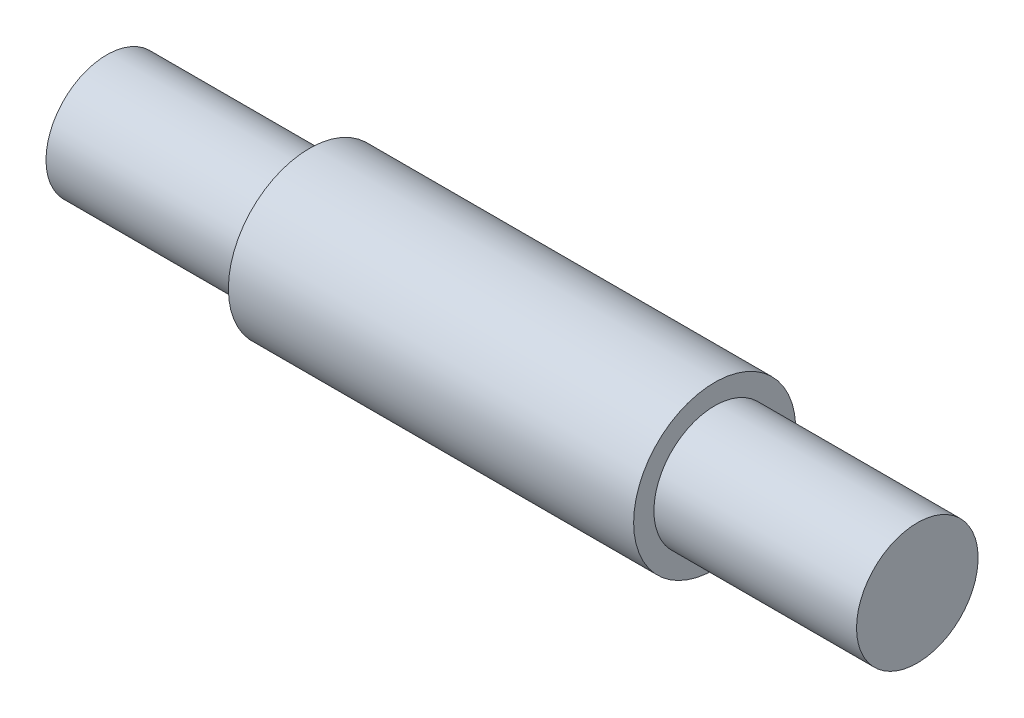
ISO-10303-21;
HEADER;
FILE_DESCRIPTION(('STEP AP214'),'2;1');
FILE_NAME('part.step','',(''),(''),'','','');
FILE_SCHEMA(('AUTOMOTIVE_DESIGN { 1 0 10303 214 1 1 1 1 }'));
ENDSEC;
DATA;
#1=APPLICATION_CONTEXT('core data for automotive mechanical design processes');
#2=APPLICATION_PROTOCOL_DEFINITION('international standard','automotive_design',2000,#1);
#3=PRODUCT_CONTEXT('',#1,'mechanical');
#4=PRODUCT('Part','Part','',(#3));
#5=PRODUCT_RELATED_PRODUCT_CATEGORY('part','',(#4));
#6=PRODUCT_DEFINITION_FORMATION('','',#4);
#7=PRODUCT_DEFINITION_CONTEXT('part definition',#1,'design');
#8=PRODUCT_DEFINITION('design','',#6,#7);
#9=PRODUCT_DEFINITION_SHAPE('','',#8);
#10=(LENGTH_UNIT() NAMED_UNIT(*) SI_UNIT(.MILLI.,.METRE.));
#11=(NAMED_UNIT(*) PLANE_ANGLE_UNIT() SI_UNIT($,.RADIAN.));
#12=(NAMED_UNIT(*) SI_UNIT($,.STERADIAN.) SOLID_ANGLE_UNIT());
#13=UNCERTAINTY_MEASURE_WITH_UNIT(LENGTH_MEASURE(1.E-05),#10,'distance_accuracy_value','');
#14=(GEOMETRIC_REPRESENTATION_CONTEXT(3) GLOBAL_UNCERTAINTY_ASSIGNED_CONTEXT((#13)) GLOBAL_UNIT_ASSIGNED_CONTEXT((#10,
#11,#12)) REPRESENTATION_CONTEXT('',''));
#15=CARTESIAN_POINT('',(0.,0.,0.));
#16=DIRECTION('',(0.,0.,1.));
#17=DIRECTION('',(1.,0.,0.));
#18=AXIS2_PLACEMENT_3D('',#15,#16,#17);
#19=CARTESIAN_POINT('',(40.,0.,0.));
#20=DIRECTION('',(-1.,0.,0.));
#21=DIRECTION('',(0.,0.,1.));
#22=AXIS2_PLACEMENT_3D('',#19,#20,#21);
#23=PLANE('',#22);
#24=CARTESIAN_POINT('',(40.,0.,0.));
#25=DIRECTION('',(-1.,0.,0.));
#26=DIRECTION('',(0.,0.,1.));
#27=AXIS2_PLACEMENT_3D('',#24,#25,#26);
#28=CIRCLE('',#27,6.);
#29=CARTESIAN_POINT('',(40.,0.,6.));
#30=VERTEX_POINT('',#29);
#31=EDGE_CURVE('E63',#30,#30,#28,.T.);
#32=ORIENTED_EDGE('',*,*,#31,.F.);
#33=EDGE_LOOP('',(#32));
#34=FACE_BOUND('',#33,.T.);
#35=ADVANCED_FACE('F41',(#34),#23,.F.);
#36=CARTESIAN_POINT('',(-40.,0.,0.));
#37=DIRECTION('',(1.,0.,0.));
#38=DIRECTION('',(0.,0.,-1.));
#39=AXIS2_PLACEMENT_3D('',#36,#37,#38);
#40=PLANE('',#39);
#41=CARTESIAN_POINT('',(-40.,0.,0.));
#42=DIRECTION('',(-1.,0.,0.));
#43=DIRECTION('',(0.,0.,1.));
#44=AXIS2_PLACEMENT_3D('',#41,#42,#43);
#45=CIRCLE('',#44,5.99999999999999);
#46=CARTESIAN_POINT('',(-40.,0.,5.99999999999999));
#47=VERTEX_POINT('',#46);
#48=EDGE_CURVE('E10',#47,#47,#45,.T.);
#49=ORIENTED_EDGE('',*,*,#48,.T.);
#50=EDGE_LOOP('',(#49));
#51=FACE_BOUND('',#50,.T.);
#52=ADVANCED_FACE('F70',(#51),#40,.F.);
#53=CARTESIAN_POINT('',(-50.,0.,0.));
#54=DIRECTION('',(-1.,0.,0.));
#55=DIRECTION('',(0.,0.,1.));
#56=AXIS2_PLACEMENT_3D('',#53,#54,#55);
#57=CYLINDRICAL_SURFACE('',#56,5.99999999999999);
#58=ORIENTED_EDGE('',*,*,#48,.F.);
#59=EDGE_LOOP('',(#58));
#60=FACE_BOUND('',#59,.T.);
#61=CARTESIAN_POINT('',(-20.,0.,0.));
#62=DIRECTION('',(-1.,0.,0.));
#63=DIRECTION('',(0.,0.,1.));
#64=AXIS2_PLACEMENT_3D('',#61,#62,#63);
#65=CIRCLE('',#64,5.99999999999999);
#66=CARTESIAN_POINT('',(-20.,0.,5.99999999999999));
#67=VERTEX_POINT('',#66);
#68=EDGE_CURVE('E47',#67,#67,#65,.T.);
#69=ORIENTED_EDGE('',*,*,#68,.T.);
#70=EDGE_LOOP('',(#69));
#71=FACE_BOUND('',#70,.T.);
#72=ADVANCED_FACE('F74',(#60,#71),#57,.T.);
#73=CARTESIAN_POINT('',(-20.,5.99999999999999,0.));
#74=DIRECTION('',(1.,0.,0.));
#75=DIRECTION('',(0.,0.,-1.));
#76=AXIS2_PLACEMENT_3D('',#73,#74,#75);
#77=PLANE('',#76);
#78=ORIENTED_EDGE('',*,*,#68,.F.);
#79=EDGE_LOOP('',(#78));
#80=FACE_BOUND('',#79,.T.);
#81=CARTESIAN_POINT('',(-20.,0.,0.));
#82=DIRECTION('',(-1.,0.,0.));
#83=DIRECTION('',(0.,0.,1.));
#84=AXIS2_PLACEMENT_3D('',#81,#82,#83);
#85=CIRCLE('',#84,7.99999999999999);
#86=CARTESIAN_POINT('',(-20.,0.,7.99999999999999));
#87=VERTEX_POINT('',#86);
#88=EDGE_CURVE('E51',#87,#87,#85,.T.);
#89=ORIENTED_EDGE('',*,*,#88,.T.);
#90=EDGE_LOOP('',(#89));
#91=FACE_BOUND('',#90,.T.);
#92=ADVANCED_FACE('F78',(#80,#91),#77,.F.);
#93=CARTESIAN_POINT('',(-50.,0.,0.));
#94=DIRECTION('',(-1.,0.,0.));
#95=DIRECTION('',(0.,0.,1.));
#96=AXIS2_PLACEMENT_3D('',#93,#94,#95);
#97=CYLINDRICAL_SURFACE('',#96,8.);
#98=ORIENTED_EDGE('',*,*,#88,.F.);
#99=EDGE_LOOP('',(#98));
#100=FACE_BOUND('',#99,.T.);
#101=CARTESIAN_POINT('',(20.,0.,0.));
#102=DIRECTION('',(-1.,0.,0.));
#103=DIRECTION('',(0.,0.,1.));
#104=AXIS2_PLACEMENT_3D('',#101,#102,#103);
#105=CIRCLE('',#104,8.);
#106=CARTESIAN_POINT('',(20.,0.,8.));
#107=VERTEX_POINT('',#106);
#108=EDGE_CURVE('E55',#107,#107,#105,.T.);
#109=ORIENTED_EDGE('',*,*,#108,.T.);
#110=EDGE_LOOP('',(#109));
#111=FACE_BOUND('',#110,.T.);
#112=ADVANCED_FACE('F84',(#100,#111),#97,.T.);
#113=CARTESIAN_POINT('',(20.,6.,0.));
#114=DIRECTION('',(-1.,0.,0.));
#115=DIRECTION('',(0.,0.,1.));
#116=AXIS2_PLACEMENT_3D('',#113,#114,#115);
#117=PLANE('',#116);
#118=ORIENTED_EDGE('',*,*,#108,.F.);
#119=EDGE_LOOP('',(#118));
#120=FACE_BOUND('',#119,.T.);
#121=CARTESIAN_POINT('',(20.,0.,0.));
#122=DIRECTION('',(-1.,0.,0.));
#123=DIRECTION('',(0.,0.,1.));
#124=AXIS2_PLACEMENT_3D('',#121,#122,#123);
#125=CIRCLE('',#124,6.);
#126=CARTESIAN_POINT('',(20.,0.,6.));
#127=VERTEX_POINT('',#126);
#128=EDGE_CURVE('E60',#127,#127,#125,.T.);
#129=ORIENTED_EDGE('',*,*,#128,.T.);
#130=EDGE_LOOP('',(#129));
#131=FACE_BOUND('',#130,.T.);
#132=ADVANCED_FACE('F88',(#120,#131),#117,.F.);
#133=CARTESIAN_POINT('',(-50.,0.,0.));
#134=DIRECTION('',(-1.,0.,0.));
#135=DIRECTION('',(0.,0.,1.));
#136=AXIS2_PLACEMENT_3D('',#133,#134,#135);
#137=CYLINDRICAL_SURFACE('',#136,6.);
#138=ORIENTED_EDGE('',*,*,#128,.F.);
#139=EDGE_LOOP('',(#138));
#140=FACE_BOUND('',#139,.T.);
#141=ORIENTED_EDGE('',*,*,#31,.T.);
#142=EDGE_LOOP('',(#141));
#143=FACE_BOUND('',#142,.T.);
#144=ADVANCED_FACE('F67',(#140,#143),#137,.T.);
#145=CLOSED_SHELL('',(#35,#52,#72,#92,#112,#132,#144));
#146=MANIFOLD_SOLID_BREP('B2',#145);
#147=ADVANCED_BREP_SHAPE_REPRESENTATION('',(#18,#146),#14);
#148=SHAPE_DEFINITION_REPRESENTATION(#9,#147);
ENDSEC;
END-ISO-10303-21;
